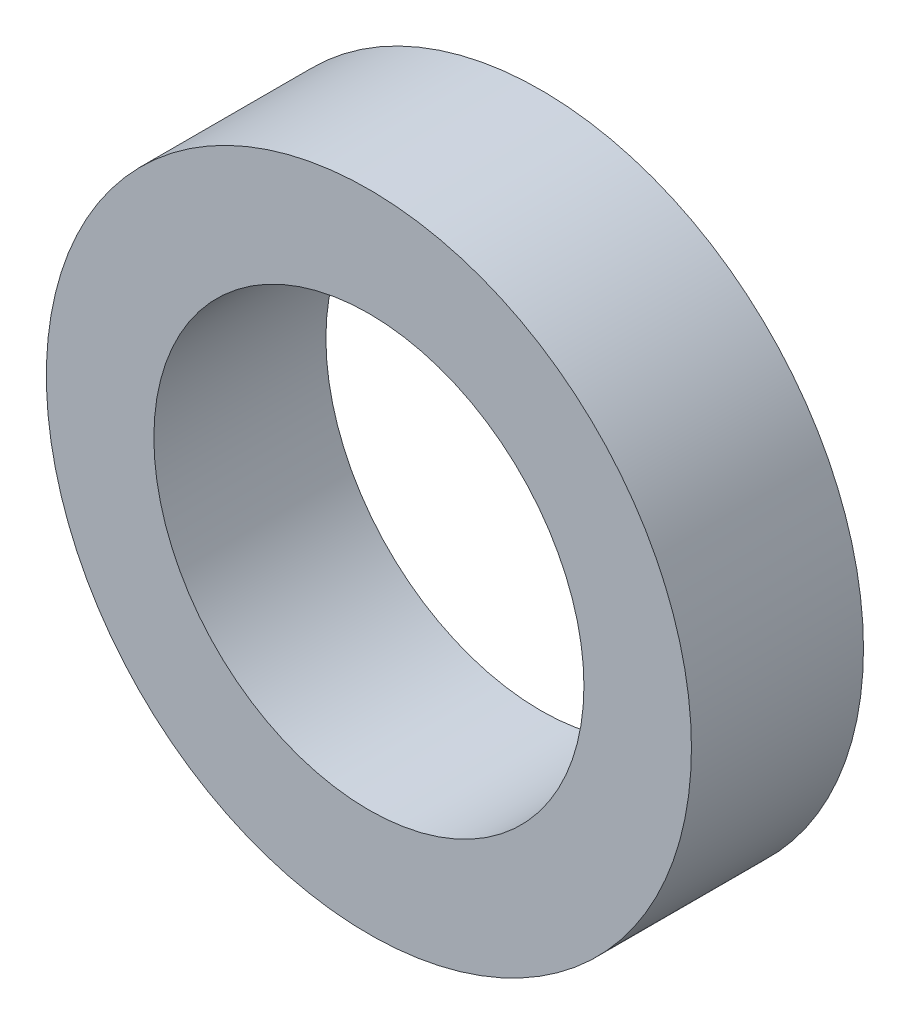
ISO-10303-21;
HEADER;
FILE_DESCRIPTION(('STEP AP214'),'2;1');
FILE_NAME('part.step','',(''),(''),'','','');
FILE_SCHEMA(('AUTOMOTIVE_DESIGN { 1 0 10303 214 1 1 1 1 }'));
ENDSEC;
DATA;
#1=APPLICATION_CONTEXT('core data for automotive mechanical design processes');
#2=APPLICATION_PROTOCOL_DEFINITION('international standard','automotive_design',2000,#1);
#3=PRODUCT_CONTEXT('',#1,'mechanical');
#4=PRODUCT('Part','Part','',(#3));
#5=PRODUCT_RELATED_PRODUCT_CATEGORY('part','',(#4));
#6=PRODUCT_DEFINITION_FORMATION('','',#4);
#7=PRODUCT_DEFINITION_CONTEXT('part definition',#1,'design');
#8=PRODUCT_DEFINITION('design','',#6,#7);
#9=PRODUCT_DEFINITION_SHAPE('','',#8);
#10=(LENGTH_UNIT() NAMED_UNIT(*) SI_UNIT(.MILLI.,.METRE.));
#11=(NAMED_UNIT(*) PLANE_ANGLE_UNIT() SI_UNIT($,.RADIAN.));
#12=(NAMED_UNIT(*) SI_UNIT($,.STERADIAN.) SOLID_ANGLE_UNIT());
#13=UNCERTAINTY_MEASURE_WITH_UNIT(LENGTH_MEASURE(1.E-05),#10,'distance_accuracy_value','');
#14=(GEOMETRIC_REPRESENTATION_CONTEXT(3) GLOBAL_UNCERTAINTY_ASSIGNED_CONTEXT((#13)) GLOBAL_UNIT_ASSIGNED_CONTEXT((#10,
#11,#12)) REPRESENTATION_CONTEXT('',''));
#15=CARTESIAN_POINT('',(0.,0.,0.));
#16=DIRECTION('',(0.,0.,1.));
#17=DIRECTION('',(1.,0.,0.));
#18=AXIS2_PLACEMENT_3D('',#15,#16,#17);
#19=CARTESIAN_POINT('',(0.,0.,4.));
#20=DIRECTION('',(0.,0.,1.));
#21=DIRECTION('',(1.,0.,0.));
#22=AXIS2_PLACEMENT_3D('',#19,#20,#21);
#23=PLANE('',#22);
#24=CARTESIAN_POINT('',(0.,0.,4.));
#25=DIRECTION('',(0.,0.,1.));
#26=DIRECTION('',(1.,0.,0.));
#27=AXIS2_PLACEMENT_3D('',#24,#25,#26);
#28=CIRCLE('',#27,7.5);
#29=CARTESIAN_POINT('',(7.5,0.,4.));
#30=VERTEX_POINT('',#29);
#31=EDGE_CURVE('E10',#30,#30,#28,.T.);
#32=ORIENTED_EDGE('',*,*,#31,.T.);
#33=EDGE_LOOP('',(#32));
#34=FACE_BOUND('',#33,.T.);
#35=CARTESIAN_POINT('',(0.,0.,4.));
#36=DIRECTION('',(0.,0.,1.));
#37=DIRECTION('',(1.,0.,0.));
#38=AXIS2_PLACEMENT_3D('',#35,#36,#37);
#39=CIRCLE('',#38,5.);
#40=CARTESIAN_POINT('',(5.,0.,4.));
#41=VERTEX_POINT('',#40);
#42=EDGE_CURVE('E50',#41,#41,#39,.T.);
#43=ORIENTED_EDGE('',*,*,#42,.F.);
#44=EDGE_LOOP('',(#43));
#45=FACE_BOUND('',#44,.T.);
#46=ADVANCED_FACE('F37',(#34,#45),#23,.T.);
#47=CARTESIAN_POINT('',(0.,0.,0.));
#48=DIRECTION('',(0.,0.,1.));
#49=DIRECTION('',(1.,0.,0.));
#50=AXIS2_PLACEMENT_3D('',#47,#48,#49);
#51=PLANE('',#50);
#52=CARTESIAN_POINT('',(0.,0.,0.));
#53=DIRECTION('',(0.,0.,1.));
#54=DIRECTION('',(1.,0.,0.));
#55=AXIS2_PLACEMENT_3D('',#52,#53,#54);
#56=CIRCLE('',#55,7.5);
#57=CARTESIAN_POINT('',(7.5,0.,0.));
#58=VERTEX_POINT('',#57);
#59=EDGE_CURVE('E41',#58,#58,#56,.T.);
#60=ORIENTED_EDGE('',*,*,#59,.F.);
#61=EDGE_LOOP('',(#60));
#62=FACE_BOUND('',#61,.T.);
#63=CARTESIAN_POINT('',(0.,0.,0.));
#64=DIRECTION('',(0.,0.,1.));
#65=DIRECTION('',(1.,0.,0.));
#66=AXIS2_PLACEMENT_3D('',#63,#64,#65);
#67=CIRCLE('',#66,5.);
#68=CARTESIAN_POINT('',(5.,0.,0.));
#69=VERTEX_POINT('',#68);
#70=EDGE_CURVE('E52',#69,#69,#67,.T.);
#71=ORIENTED_EDGE('',*,*,#70,.T.);
#72=EDGE_LOOP('',(#71));
#73=FACE_BOUND('',#72,.T.);
#74=ADVANCED_FACE('F64',(#62,#73),#51,.F.);
#75=CARTESIAN_POINT('',(0.,0.,4.));
#76=DIRECTION('',(0.,0.,-1.));
#77=DIRECTION('',(-1.,0.,0.));
#78=AXIS2_PLACEMENT_3D('',#75,#76,#77);
#79=CYLINDRICAL_SURFACE('',#78,7.5);
#80=ORIENTED_EDGE('',*,*,#31,.F.);
#81=EDGE_LOOP('',(#80));
#82=FACE_BOUND('',#81,.T.);
#83=ORIENTED_EDGE('',*,*,#59,.T.);
#84=EDGE_LOOP('',(#83));
#85=FACE_BOUND('',#84,.T.);
#86=ADVANCED_FACE('F39',(#82,#85),#79,.T.);
#87=CARTESIAN_POINT('',(0.,0.,4.));
#88=DIRECTION('',(0.,0.,-1.));
#89=DIRECTION('',(-1.,0.,0.));
#90=AXIS2_PLACEMENT_3D('',#87,#88,#89);
#91=CYLINDRICAL_SURFACE('',#90,5.);
#92=ORIENTED_EDGE('',*,*,#42,.T.);
#93=EDGE_LOOP('',(#92));
#94=FACE_BOUND('',#93,.T.);
#95=ORIENTED_EDGE('',*,*,#70,.F.);
#96=EDGE_LOOP('',(#95));
#97=FACE_BOUND('',#96,.T.);
#98=ADVANCED_FACE('F60',(#94,#97),#91,.F.);
#99=CLOSED_SHELL('',(#46,#74,#86,#98));
#100=MANIFOLD_SOLID_BREP('B2',#99);
#101=ADVANCED_BREP_SHAPE_REPRESENTATION('',(#18,#100),#14);
#102=SHAPE_DEFINITION_REPRESENTATION(#9,#101);
ENDSEC;
END-ISO-10303-21;
